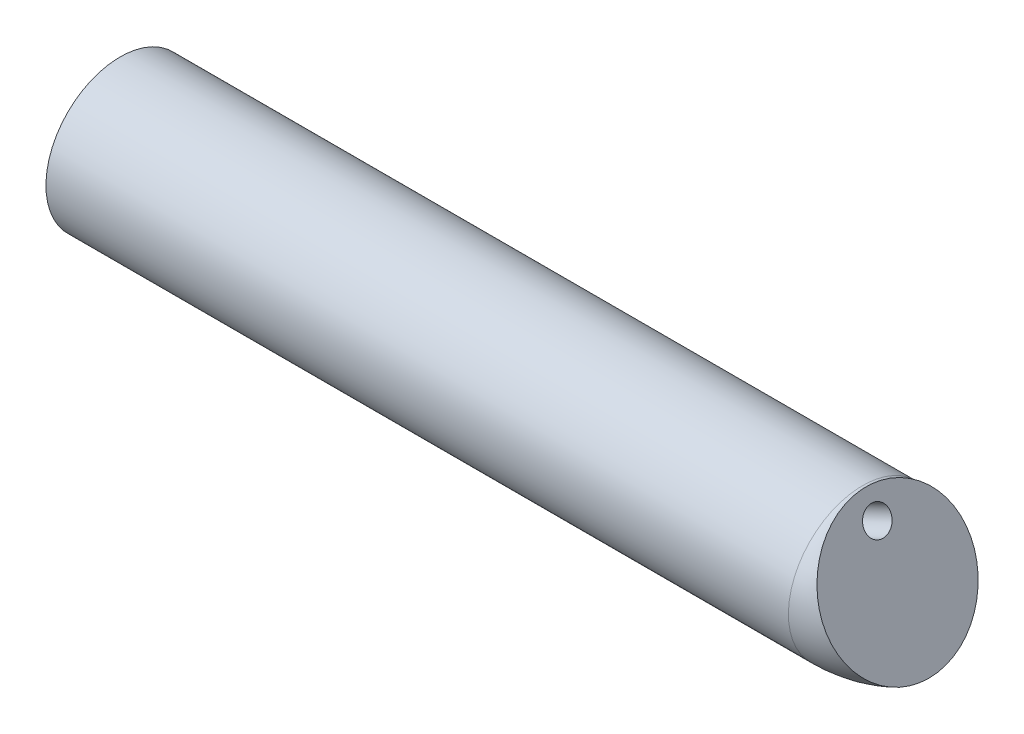
ISO-10303-21;
HEADER;
FILE_DESCRIPTION(('STEP AP214'),'2;1');
FILE_NAME('part.step','',(''),(''),'','','');
FILE_SCHEMA(('AUTOMOTIVE_DESIGN { 1 0 10303 214 1 1 1 1 }'));
ENDSEC;
DATA;
#1=APPLICATION_CONTEXT('core data for automotive mechanical design processes');
#2=APPLICATION_PROTOCOL_DEFINITION('international standard','automotive_design',2000,#1);
#3=PRODUCT_CONTEXT('',#1,'mechanical');
#4=PRODUCT('Part','Part','',(#3));
#5=PRODUCT_RELATED_PRODUCT_CATEGORY('part','',(#4));
#6=PRODUCT_DEFINITION_FORMATION('','',#4);
#7=PRODUCT_DEFINITION_CONTEXT('part definition',#1,'design');
#8=PRODUCT_DEFINITION('design','',#6,#7);
#9=PRODUCT_DEFINITION_SHAPE('','',#8);
#10=(LENGTH_UNIT() NAMED_UNIT(*) SI_UNIT(.MILLI.,.METRE.));
#11=(NAMED_UNIT(*) PLANE_ANGLE_UNIT() SI_UNIT($,.RADIAN.));
#12=(NAMED_UNIT(*) SI_UNIT($,.STERADIAN.) SOLID_ANGLE_UNIT());
#13=UNCERTAINTY_MEASURE_WITH_UNIT(LENGTH_MEASURE(1.E-05),#10,'distance_accuracy_value','');
#14=(GEOMETRIC_REPRESENTATION_CONTEXT(3) GLOBAL_UNCERTAINTY_ASSIGNED_CONTEXT((#13)) GLOBAL_UNIT_ASSIGNED_CONTEXT((#10,
#11,#12)) REPRESENTATION_CONTEXT('',''));
#15=CARTESIAN_POINT('',(0.,0.,0.));
#16=DIRECTION('',(0.,0.,1.));
#17=DIRECTION('',(1.,0.,0.));
#18=AXIS2_PLACEMENT_3D('',#15,#16,#17);
#19=CARTESIAN_POINT('',(52.2600061469456,-12.2327110275854,0.));
#20=DIRECTION('',(0.906307787036649,0.4226182617407,0.));
#21=DIRECTION('',(-0.4226182617407,0.906307787036649,0.));
#22=AXIS2_PLACEMENT_3D('',#19,#20,#21);
#23=CYLINDRICAL_SURFACE('',#22,1.65);
#24=CARTESIAN_POINT('',(85.7933942673016,3.40416465682054,0.));
#25=DIRECTION('',(-0.906307787036649,-0.4226182617407,0.));
#26=DIRECTION('',(0.4226182617407,-0.906307787036649,0.));
#27=AXIS2_PLACEMENT_3D('',#24,#25,#26);
#28=CIRCLE('',#27,1.65);
#29=CARTESIAN_POINT('',(86.4907143991738,1.90875680821007,0.));
#30=VERTEX_POINT('',#29);
#31=EDGE_CURVE('E41',#30,#30,#28,.F.);
#32=ORIENTED_EDGE('',*,*,#31,.F.);
#33=EDGE_LOOP('',(#32));
#34=FACE_BOUND('',#33,.T.);
#35=CARTESIAN_POINT('',(91.7750256617434,6.19344518430913,0.));
#36=DIRECTION('',(0.90630778703665,0.4226182617407,0.));
#37=DIRECTION('',(-0.4226182617407,0.90630778703665,0.));
#38=AXIS2_PLACEMENT_3D('',#35,#36,#37);
#39=CIRCLE('',#38,1.65);
#40=CARTESIAN_POINT('',(91.0777055298713,7.6888530329196,0.));
#41=VERTEX_POINT('',#40);
#42=EDGE_CURVE('E133',#41,#41,#39,.F.);
#43=ORIENTED_EDGE('',*,*,#42,.F.);
#44=EDGE_LOOP('',(#43));
#45=FACE_BOUND('',#44,.T.);
#46=ADVANCED_FACE('F36',(#34,#45),#23,.F.);
#47=CARTESIAN_POINT('',(90.,0.,0.));
#48=DIRECTION('',(-1.,0.,0.));
#49=DIRECTION('',(0.,0.,1.));
#50=AXIS2_PLACEMENT_3D('',#47,#48,#49);
#51=CYLINDRICAL_SURFACE('',#50,9.);
#52=CARTESIAN_POINT('',(0.,0.,0.));
#53=DIRECTION('',(1.,0.,0.));
#54=DIRECTION('',(0.,0.,-1.));
#55=AXIS2_PLACEMENT_3D('',#52,#53,#54);
#56=CIRCLE('',#55,9.);
#57=CARTESIAN_POINT('',(0.,0.,-9.));
#58=VERTEX_POINT('',#57);
#59=EDGE_CURVE('E46',#58,#58,#56,.T.);
#60=ORIENTED_EDGE('',*,*,#59,.T.);
#61=EDGE_LOOP('',(#60));
#62=FACE_BOUND('',#61,.T.);
#63=CARTESIAN_POINT('',(90.,0.,0.));
#64=DIRECTION('',(1.,0.,0.));
#65=DIRECTION('',(0.,0.,-1.));
#66=AXIS2_PLACEMENT_3D('',#63,#64,#65);
#67=CIRCLE('',#66,9.);
#68=CARTESIAN_POINT('',(90.,-9.,0.));
#69=VERTEX_POINT('',#68);
#70=EDGE_CURVE('E10',#69,#69,#67,.T.);
#71=ORIENTED_EDGE('',*,*,#70,.F.);
#72=EDGE_LOOP('',(#71));
#73=FACE_BOUND('',#72,.T.);
#74=CARTESIAN_POINT('',(51.9756624889949,-8.99999999999996,0.));
#75=CARTESIAN_POINT('',(51.9756663651137,-8.99999955690305,-0.0636494247475675));
#76=CARTESIAN_POINT('',(51.9819048464244,-8.99931557904606,-0.127310166572622));
#77=CARTESIAN_POINT('',(52.0059971409282,-8.99667937868401,-0.252381235362551));
#78=CARTESIAN_POINT('',(52.0238695761558,-8.99472512289989,-0.313787787373163));
#79=CARTESIAN_POINT('',(52.0748762131331,-8.98916504063614,-0.447737145287557));
#80=CARTESIAN_POINT('',(52.110711053725,-8.98526822530375,-0.519219209856807));
#81=CARTESIAN_POINT('',(52.1931253098323,-8.97635358271267,-0.655575310266585));
#82=CARTESIAN_POINT('',(52.2397279570719,-8.97133333237223,-0.720434614713134));
#83=CARTESIAN_POINT('',(52.3342487210156,-8.96121434159784,-0.836418693680466));
#84=CARTESIAN_POINT('',(52.3813217033705,-8.95619897516899,-0.888255167421392));
#85=CARTESIAN_POINT('',(52.4797274594068,-8.94577726691599,-0.987710354937496));
#86=CARTESIAN_POINT('',(52.531063743426,-8.94037060338403,-1.03532552491319));
#87=CARTESIAN_POINT('',(52.6370100754499,-8.92928541534771,-1.12694036474358));
#88=CARTESIAN_POINT('',(52.6916271492374,-8.92360631306044,-1.17093175965815));
#89=CARTESIAN_POINT('',(52.8032700082185,-8.9120792942799,-1.25565409812296));
#90=CARTESIAN_POINT('',(52.8602950066924,-8.90623143311839,-1.29638609418677));
#91=CARTESIAN_POINT('',(53.0031767353744,-8.89168899624757,-1.39329322252307));
#92=CARTESIAN_POINT('',(53.0901211659715,-8.88293395519548,-1.44785250079788));
#93=CARTESIAN_POINT('',(53.2669766483503,-8.86533844936496,-1.55195193690743));
#94=CARTESIAN_POINT('',(53.35688912356,-8.85649794508018,-1.6014896387155));
#95=CARTESIAN_POINT('',(53.5390773537313,-8.83881610622354,-1.69636733689601));
#96=CARTESIAN_POINT('',(53.6313566994351,-8.82997479348343,-1.74170040677463));
#97=CARTESIAN_POINT('',(53.8176565903877,-8.81237402463507,-1.82866766686179));
#98=CARTESIAN_POINT('',(53.9116774325471,-8.8036145828754,-1.87030121918646));
#99=CARTESIAN_POINT('',(54.196842760336,-8.77744595238503,-1.99079527831162));
#100=CARTESIAN_POINT('',(54.3900882147017,-8.76024413914943,-2.06474257720776));
#101=CARTESIAN_POINT('',(54.7800948095816,-8.72672725981417,-2.20208661618297));
#102=CARTESIAN_POINT('',(54.9768525726403,-8.71041139700509,-2.26549294491714));
#103=CARTESIAN_POINT('',(55.3917848905055,-8.67738362605918,-2.3890336729678));
#104=CARTESIAN_POINT('',(55.6102273328546,-8.66077980937962,-2.44829370214376));
#105=CARTESIAN_POINT('',(56.049540794941,-8.62913096662953,-2.55760136222164));
#106=CARTESIAN_POINT('',(56.2704122832503,-8.61408624736287,-2.60764718142275));
#107=CARTESIAN_POINT('',(56.7142511841405,-8.58577345971237,-2.69940718546785));
#108=CARTESIAN_POINT('',(56.9372207175503,-8.57250745736126,-2.74111170881431));
#109=CARTESIAN_POINT('',(57.3846078911924,-8.54800163097228,-2.81660082139117));
#110=CARTESIAN_POINT('',(57.6090255629115,-8.5367618511453,-2.8503852378147));
#111=CARTESIAN_POINT('',(58.0578722796724,-8.51659514210246,-2.91008482096567));
#112=CARTESIAN_POINT('',(58.2822957417922,-8.50765701227769,-2.93603820645596));
#113=CARTESIAN_POINT('',(58.7319986872433,-8.4922661532381,-2.98026235800593));
#114=CARTESIAN_POINT('',(58.9572782177983,-8.48581356320499,-2.9985326938464));
#115=CARTESIAN_POINT('',(59.4081864597079,-8.47566145984339,-3.02710959911417));
#116=CARTESIAN_POINT('',(59.6338146145057,-8.471959261629,-3.03742393543115));
#117=CARTESIAN_POINT('',(60.0853091945522,-8.46757687673886,-3.04962094879847));
#118=CARTESIAN_POINT('',(60.3111755809177,-8.4668962560295,-3.05150483683842));
#119=CARTESIAN_POINT('',(60.7086909701299,-8.46861631973826,-3.04672580681262));
#120=CARTESIAN_POINT('',(60.8803670619453,-8.47031795874079,-3.0420021031757));
#121=CARTESIAN_POINT('',(61.2234343677389,-8.4757715579457,-3.02677455239386));
#122=CARTESIAN_POINT('',(61.3948255876224,-8.47952347510148,-3.0162708266033));
#123=CARTESIAN_POINT('',(61.7376476820826,-8.48922676781908,-2.9888532532699));
#124=CARTESIAN_POINT('',(61.9090765871904,-8.49518581183736,-2.97191705140611));
#125=CARTESIAN_POINT('',(62.2509762911875,-8.50942611731686,-2.93089356251591));
#126=CARTESIAN_POINT('',(62.4214471505997,-8.51770723036407,-2.90680673251295));
#127=CARTESIAN_POINT('',(62.8006600164467,-8.53892155007993,-2.8439733864405));
#128=CARTESIAN_POINT('',(63.0090266321104,-8.55248984116228,-2.80311568514864));
#129=CARTESIAN_POINT('',(63.4222981580359,-8.58345364910796,-2.70682449439819));
#130=CARTESIAN_POINT('',(63.6272006065547,-8.60085177383769,-2.65138106797095));
#131=CARTESIAN_POINT('',(64.0299424615309,-8.63926965788453,-2.52338587846972));
#132=CARTESIAN_POINT('',(64.2278175651379,-8.66026647820132,-2.4509414653491));
#133=CARTESIAN_POINT('',(64.6140729305614,-8.70548346026599,-2.28516757553495));
#134=CARTESIAN_POINT('',(64.8024707683744,-8.72969732728885,-2.19187864781537));
#135=CARTESIAN_POINT('',(65.1101735280788,-8.77263645257202,-2.01162242141247));
#136=CARTESIAN_POINT('',(65.2333008843504,-8.79083942487106,-1.93109757447489));
#137=CARTESIAN_POINT('',(65.4692763932786,-8.82751769291272,-1.7558378084416));
#138=CARTESIAN_POINT('',(65.5821172000167,-8.84599317248968,-1.66109286018299));
#139=CARTESIAN_POINT('',(65.794278573593,-8.88222509149124,-1.45503911120107));
#140=CARTESIAN_POINT('',(65.89344474279,-8.89997194446114,-1.34356684077233));
#141=CARTESIAN_POINT('',(66.0707761119386,-8.93276330462335,-1.10460677306168));
#142=CARTESIAN_POINT('',(66.1489872501163,-8.94781369865229,-0.977154922902592));
#143=CARTESIAN_POINT('',(66.259900905177,-8.96960766924214,-0.745455994389214));
#144=CARTESIAN_POINT('',(66.299204304307,-8.97749744183523,-0.644479999231536));
#145=CARTESIAN_POINT('',(66.3607860692299,-8.98996943468515,-0.437247369010214));
#146=CARTESIAN_POINT('',(66.3830770172025,-8.99455409921599,-0.330994698571558));
#147=CARTESIAN_POINT('',(66.4090412374005,-8.99990198003317,-0.115716052059449));
#148=CARTESIAN_POINT('',(66.412646372111,-9.00065121034858,-0.00668138109885762));
#149=CARTESIAN_POINT('',(66.4007644298451,-8.99819711115295,0.210296463363843));
#150=CARTESIAN_POINT('',(66.3852750727156,-8.9949933095938,0.318239504957945));
#151=CARTESIAN_POINT('',(66.3376518454897,-8.98527225043045,0.524420590830745));
#152=CARTESIAN_POINT('',(66.3063949195606,-8.97892987257022,0.622873656807894));
#153=CARTESIAN_POINT('',(66.2296995192152,-8.96364270464429,0.813820230060118));
#154=CARTESIAN_POINT('',(66.184256162626,-8.9546970187381,0.906311672438492));
#155=CARTESIAN_POINT('',(66.0597369440561,-8.930738218113,1.12165142535313));
#156=CARTESIAN_POINT('',(65.9745588919778,-8.91475710057576,1.2408594383511));
#157=CARTESIAN_POINT('',(65.7862644740742,-8.88087216785402,1.46387332818729));
#158=CARTESIAN_POINT('',(65.6831081500779,-8.86296410453337,1.56764392114366));
#159=CARTESIAN_POINT('',(65.4902908772236,-8.83105521187709,1.73723833355851));
#160=CARTESIAN_POINT('',(65.403313713336,-8.81714566206696,1.806198472997));
#161=CARTESIAN_POINT('',(65.2235690903228,-8.78951007745444,1.93621701390778));
#162=CARTESIAN_POINT('',(65.1307984969068,-8.7757841469532,1.99727108226781));
#163=CARTESIAN_POINT('',(64.9407182419144,-8.74883672003547,2.11218915877076));
#164=CARTESIAN_POINT('',(64.8434032325771,-8.73561585299806,2.1660443923232));
#165=CARTESIAN_POINT('',(64.64530679595,-8.70991262475441,2.26718649779678));
#166=CARTESIAN_POINT('',(64.5445240702113,-8.6974305450442,2.31447087519306));
#167=CARTESIAN_POINT('',(64.2579701043136,-8.66365918200264,2.43884288902149));
#168=CARTESIAN_POINT('',(64.069164186564,-8.64337922147406,2.50923792655759));
#169=CARTESIAN_POINT('',(63.6859892678274,-8.60617333503185,2.63400390399949));
#170=CARTESIAN_POINT('',(63.4916157376054,-8.58925023401427,2.68836136640291));
#171=CARTESIAN_POINT('',(63.098831186342,-8.55881740904766,2.78372928375426));
#172=CARTESIAN_POINT('',(62.9004104664725,-8.54531727756969,2.82470232096367));
#173=CARTESIAN_POINT('',(62.5014277103415,-8.52171689746561,2.89511799761973));
#174=CARTESIAN_POINT('',(62.3008662215181,-8.51161580015525,2.92456351560331));
#175=CARTESIAN_POINT('',(61.893824099706,-8.49444673491726,2.97406659687377));
#176=CARTESIAN_POINT('',(61.687312900185,-8.48745331380449,2.99389437627414));
#177=CARTESIAN_POINT('',(61.2735110928439,-8.47662089374531,3.02442651002777));
#178=CARTESIAN_POINT('',(61.0662203337333,-8.47278254261508,3.03512899074176));
#179=CARTESIAN_POINT('',(60.6511578835538,-8.46802549654896,3.04837517835305));
#180=CARTESIAN_POINT('',(60.4433859220002,-8.46710960202335,3.05091105972244));
#181=CARTESIAN_POINT('',(60.0279135210457,-8.46797151625161,3.04851739869335));
#182=CARTESIAN_POINT('',(59.8202130776328,-8.46974913495283,3.04358838301346));
#183=CARTESIAN_POINT('',(59.4052260241646,-8.47577169112345,3.02677601575291));
#184=CARTESIAN_POINT('',(59.1979392728872,-8.48001554959655,3.01489570539435));
#185=CARTESIAN_POINT('',(58.7839097131748,-8.49075756165582,2.98450926595069));
#186=CARTESIAN_POINT('',(58.5771669146984,-8.4972557562293,2.96600301639561));
#187=CARTESIAN_POINT('',(58.1645786083811,-8.51230153363711,2.92254186355087));
#188=CARTESIAN_POINT('',(57.958732588164,-8.52084772716825,2.89759133098732));
#189=CARTESIAN_POINT('',(57.5480262882563,-8.53980306851461,2.8412408176698));
#190=CARTESIAN_POINT('',(57.3431659255773,-8.55021205656803,2.80984138996852));
#191=CARTESIAN_POINT('',(56.9851617924535,-8.56993225090569,2.7490021930501));
#192=CARTESIAN_POINT('',(56.8317527942828,-8.57887871399393,2.72099689512507));
#193=CARTESIAN_POINT('',(56.5257562587105,-8.59765095903179,2.66108712450783));
#194=CARTESIAN_POINT('',(56.3731686857356,-8.60747670257226,2.62918282211156));
#195=CARTESIAN_POINT('',(56.06906136653,-8.62792668514745,2.56127670111465));
#196=CARTESIAN_POINT('',(55.9175410058461,-8.63855041511355,2.52527748741252));
#197=CARTESIAN_POINT('',(55.615671635003,-8.66052538851645,2.44885322487925));
#198=CARTESIAN_POINT('',(55.4653226108266,-8.67187662323227,2.40842822909813));
#199=CARTESIAN_POINT('',(55.1660784516955,-8.69522419774503,2.32272480938222));
#200=CARTESIAN_POINT('',(55.0171831387397,-8.7072204573604,2.2774469879992));
#201=CARTESIAN_POINT('',(54.7212092307048,-8.73176782054822,2.18144164622529));
#202=CARTESIAN_POINT('',(54.5741305063287,-8.7443188843375,2.13071451621448));
#203=CARTESIAN_POINT('',(54.2822986775216,-8.76987061589505,2.0229785575357));
#204=CARTESIAN_POINT('',(54.1375457194371,-8.78287131179499,1.96596933533293));
#205=CARTESIAN_POINT('',(53.8512654426228,-8.80917592581465,1.84452590700949));
#206=CARTESIAN_POINT('',(53.7097370009354,-8.82247973504243,1.78009433461524));
#207=CARTESIAN_POINT('',(53.4161239053311,-8.85064393584365,1.63469239246022));
#208=CARTESIAN_POINT('',(53.2645371135339,-8.86551810693729,1.55268908079403));
#209=CARTESIAN_POINT('',(53.043829306873,-8.88759599770733,1.4186819557328));
#210=CARTESIAN_POINT('',(52.9713787417104,-8.89491570829085,1.37218421665086));
#211=CARTESIAN_POINT('',(52.8294372138151,-8.90938458108624,1.27486909071466));
#212=CARTESIAN_POINT('',(52.7599451139842,-8.91653380835072,1.22405338640279));
#213=CARTESIAN_POINT('',(52.6086727937967,-8.93222334270085,1.10447475513035));
#214=CARTESIAN_POINT('',(52.5279557244502,-8.94068478791927,1.03433440804754));
#215=CARTESIAN_POINT('',(52.3758828733856,-8.9567636020269,0.884347724555244));
#216=CARTESIAN_POINT('',(52.3045123971974,-8.96438229287015,0.804517013349998));
#217=CARTESIAN_POINT('',(52.1982068393321,-8.97580511119017,0.661946861233497));
#218=CARTESIAN_POINT('',(52.159067524503,-8.98003300844958,0.602415425864506));
#219=CARTESIAN_POINT('',(52.09010662878,-8.98750754468401,0.47808747734335));
#220=CARTESIAN_POINT('',(52.0602695895776,-8.99075581129011,0.413299926971389));
#221=CARTESIAN_POINT('',(52.0170183796832,-8.9954738984155,0.290742550855112));
#222=CARTESIAN_POINT('',(52.0016643971794,-8.99715327638265,0.233676859099132));
#223=CARTESIAN_POINT('',(51.9809898889113,-8.99941596079844,0.117742709636691));
#224=CARTESIAN_POINT('',(51.9756589035559,-9.00000040986793,0.0588761964842716));
#225=CARTESIAN_POINT('',(51.9756624889949,-8.99999999999996,0.));
#226=B_SPLINE_CURVE_WITH_KNOTS('',3,(#74,#75,#76,#77,#78,#79,#80,#81,#82,#83,#84,#85,#86,#87,
#88,#89,#90,#91,#92,#93,#94,#95,#96,#97,#98,#99,#100,#101,#102,#103,#104,#105,#106,#107,#108,
#109,#110,#111,#112,#113,#114,#115,#116,#117,#118,#119,#120,#121,#122,#123,#124,#125,#126,#127,
#128,#129,#130,#131,#132,#133,#134,#135,#136,#137,#138,#139,#140,#141,#142,#143,#144,#145,#146,
#147,#148,#149,#150,#151,#152,#153,#154,#155,#156,#157,#158,#159,#160,#161,#162,#163,#164,#165,
#166,#167,#168,#169,#170,#171,#172,#173,#174,#175,#176,#177,#178,#179,#180,#181,#182,#183,#184,
#185,#186,#187,#188,#189,#190,#191,#192,#193,#194,#195,#196,#197,#198,#199,#200,#201,#202,#203,
#204,#205,#206,#207,#208,#209,#210,#211,#212,#213,#214,#215,#216,#217,#218,#219,#220,#221,#222,
#223,#224,#225),.UNSPECIFIED.,.T.,.F.,(4,2,2,2,2,2,2,2,2,2,2,2,2,2,2,2,2,2,2,2,2,2,2,2,2,2,2,2,
2,2,2,2,2,2,2,2,2,2,2,2,2,2,2,2,2,2,2,2,2,2,2,2,2,2,2,2,2,2,2,2,2,2,2,2,2,2,2,2,2,2,2,2,2,2,2,
4),(0.,0.190684241565533,0.381674457290227,0.62047945654277,0.859804573742259,1.07010200045337,
1.28057433309481,1.49151467673015,1.7023866270456,2.0112165546723,2.32019680790264,
2.62967734003835,2.93921113077365,3.56165148293085,4.18352249314755,4.86411702894511,
5.5448452408754,6.22635741306063,6.90788445360834,7.586029452402,8.26421241947398,
8.94173248276177,9.61915522072723,10.1343073289746,10.649448621767,11.1663967760251,
11.6833118973001,12.3211420148189,12.9594078039125,13.5937469426515,14.2268626774391,
14.6707728881048,15.1149976642031,15.5638866445473,16.0117833527382,16.3363762934673,
16.6607289363706,16.9862634980041,17.3118369368454,17.6210244504922,17.9303184866392,
18.3700025597991,18.8106766279055,19.1458233091229,19.4811529050228,19.8168875746748,
20.1527493546734,20.759289621079,21.3663381634959,21.9750695401866,22.5836488134533,
23.2061281670221,23.8287352995424,24.4519388592666,25.0750984481767,25.6979856056591,
26.3208840887845,26.943361205869,27.5657849620291,28.0343387898916,28.5028721601444,
28.9711091314078,29.4393404907211,29.9075137792257,30.3756535508547,30.8438226652768,
31.3118261646066,31.8300720711212,32.0891452487587,32.348117934606,32.6693613414723,
32.9900934743904,33.2036047039133,33.4167592105217,33.5933279301677,33.7697122874088),.UNSPECIFIED.);
#227=CARTESIAN_POINT('',(51.9756624889949,-8.99999999999996,0.));
#228=VERTEX_POINT('',#227);
#229=EDGE_CURVE('E56',#228,#228,#226,.T.);
#230=ORIENTED_EDGE('',*,*,#229,.F.);
#231=EDGE_LOOP('',(#230));
#232=FACE_BOUND('',#231,.T.);
#233=ADVANCED_FACE('F38',(#62,#73,#232),#51,.T.);
#234=CARTESIAN_POINT('',(0.,0.,0.));
#235=DIRECTION('',(1.,0.,0.));
#236=DIRECTION('',(0.,0.,-1.));
#237=AXIS2_PLACEMENT_3D('',#234,#235,#236);
#238=PLANE('',#237);
#239=ORIENTED_EDGE('',*,*,#59,.F.);
#240=EDGE_LOOP('',(#239));
#241=FACE_BOUND('',#240,.T.);
#242=ADVANCED_FACE('F77',(#241),#238,.F.);
#243=CARTESIAN_POINT('',(90.,10.,0.));
#244=DIRECTION('',(0.,0.,-1.));
#245=DIRECTION('',(-1.,0.,0.));
#246=AXIS2_PLACEMENT_3D('',#243,#244,#245);
#247=TOROIDAL_SURFACE('',#246,10.,9.);
#248=CARTESIAN_POINT('',(94.226182617407,0.9369221296335,0.));
#249=DIRECTION('',(0.90630778703665,0.4226182617407,0.));
#250=DIRECTION('',(-0.4226182617407,0.90630778703665,0.));
#251=AXIS2_PLACEMENT_3D('',#248,#249,#250);
#252=CIRCLE('',#251,9.);
#253=CARTESIAN_POINT('',(98.0297469730733,-7.21984795369635,0.));
#254=VERTEX_POINT('',#253);
#255=EDGE_CURVE('E130',#254,#254,#252,.T.);
#256=CARTESIAN_POINT('',(90.,10.,0.));
#257=DIRECTION('',(0.,0.,-1.));
#258=DIRECTION('',(-1.,0.,0.));
#259=AXIS2_PLACEMENT_3D('',#256,#257,#258);
#260=CIRCLE('',#259,19.);
#261=EDGE_CURVE('',#254,#69,#260,.T.);
#262=ORIENTED_EDGE('',*,*,#255,.F.);
#263=ORIENTED_EDGE('',*,*,#70,.T.);
#264=ORIENTED_EDGE('',*,*,#261,.T.);
#265=ORIENTED_EDGE('',*,*,#261,.F.);
#266=EDGE_LOOP('',(#262,#264,#263,#265));
#267=FACE_BOUND('',#266,.T.);
#268=ADVANCED_FACE('F75',(#267),#247,.T.);
#269=CARTESIAN_POINT('',(85.7933942673016,3.40416465682055,0.));
#270=DIRECTION('',(-0.906307787036649,-0.4226182617407,0.));
#271=DIRECTION('',(0.4226182617407,-0.906307787036649,0.));
#272=AXIS2_PLACEMENT_3D('',#269,#270,#271);
#273=PLANE('',#272);
#274=CARTESIAN_POINT('',(85.7933942673016,3.40416465682055,0.));
#275=DIRECTION('',(-0.906307787036649,-0.4226182617407,0.));
#276=DIRECTION('',(0.4226182617407,-0.906307787036649,0.));
#277=AXIS2_PLACEMENT_3D('',#274,#275,#276);
#278=CIRCLE('',#277,3.05);
#279=CARTESIAN_POINT('',(87.0823799656108,0.639925906358765,0.));
#280=VERTEX_POINT('',#279);
#281=EDGE_CURVE('E54',#280,#280,#278,.T.);
#282=ORIENTED_EDGE('',*,*,#281,.T.);
#283=EDGE_LOOP('',(#282));
#284=FACE_BOUND('',#283,.T.);
#285=ORIENTED_EDGE('',*,*,#31,.T.);
#286=EDGE_LOOP('',(#285));
#287=FACE_BOUND('',#286,.T.);
#288=ADVANCED_FACE('F69',(#284,#287),#273,.T.);
#289=CARTESIAN_POINT('',(32.683757946954,-21.3612654811845,0.));
#290=DIRECTION('',(0.906307787036649,0.4226182617407,0.));
#291=DIRECTION('',(-0.4226182617407,0.90630778703665,0.));
#292=AXIS2_PLACEMENT_3D('',#289,#290,#291);
#293=CYLINDRICAL_SURFACE('',#292,3.05);
#294=ORIENTED_EDGE('',*,*,#281,.F.);
#295=EDGE_LOOP('',(#294));
#296=FACE_BOUND('',#295,.T.);
#297=ORIENTED_EDGE('',*,*,#229,.T.);
#298=EDGE_LOOP('',(#297));
#299=FACE_BOUND('',#298,.T.);
#300=ADVANCED_FACE('F63',(#296,#299),#293,.F.);
#301=CARTESIAN_POINT('',(59.9792102155821,74.3797914518467,100.));
#302=DIRECTION('',(0.90630778703665,0.4226182617407,0.));
#303=DIRECTION('',(-0.4226182617407,0.90630778703665,0.));
#304=AXIS2_PLACEMENT_3D('',#301,#302,#303);
#305=PLANE('',#304);
#306=ORIENTED_EDGE('',*,*,#255,.T.);
#307=EDGE_LOOP('',(#306));
#308=FACE_BOUND('',#307,.T.);
#309=ORIENTED_EDGE('',*,*,#42,.T.);
#310=EDGE_LOOP('',(#309));
#311=FACE_BOUND('',#310,.T.);
#312=ADVANCED_FACE('F68',(#308,#311),#305,.T.);
#313=CLOSED_SHELL('',(#46,#233,#242,#268,#288,#300,#312));
#314=MANIFOLD_SOLID_BREP('B2',#313);
#315=ADVANCED_BREP_SHAPE_REPRESENTATION('',(#18,#314),#14);
#316=SHAPE_DEFINITION_REPRESENTATION(#9,#315);
ENDSEC;
END-ISO-10303-21;
